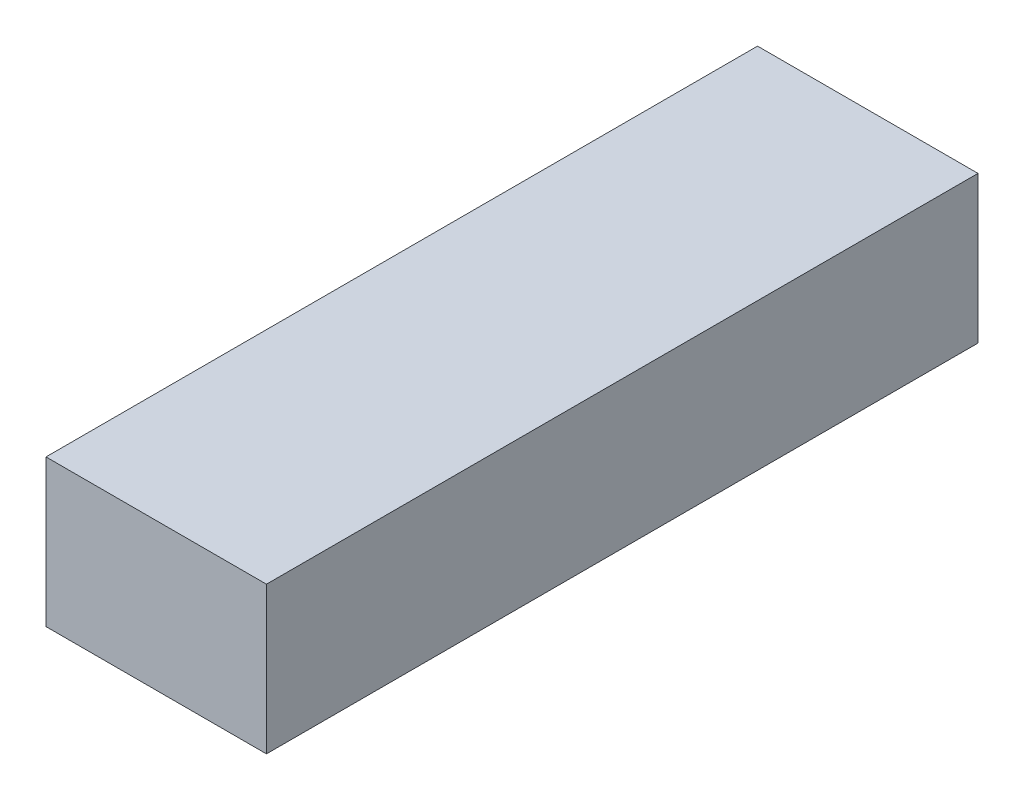
ISO-10303-21;
HEADER;
FILE_DESCRIPTION(('STEP AP214'),'2;1');
FILE_NAME('part.step','',(''),(''),'','','');
FILE_SCHEMA(('AUTOMOTIVE_DESIGN { 1 0 10303 214 1 1 1 1 }'));
ENDSEC;
DATA;
#1=APPLICATION_CONTEXT('core data for automotive mechanical design processes');
#2=APPLICATION_PROTOCOL_DEFINITION('international standard','automotive_design',2000,#1);
#3=PRODUCT_CONTEXT('',#1,'mechanical');
#4=PRODUCT('Part','Part','',(#3));
#5=PRODUCT_RELATED_PRODUCT_CATEGORY('part','',(#4));
#6=PRODUCT_DEFINITION_FORMATION('','',#4);
#7=PRODUCT_DEFINITION_CONTEXT('part definition',#1,'design');
#8=PRODUCT_DEFINITION('design','',#6,#7);
#9=PRODUCT_DEFINITION_SHAPE('','',#8);
#10=(LENGTH_UNIT() NAMED_UNIT(*) SI_UNIT(.MILLI.,.METRE.));
#11=(NAMED_UNIT(*) PLANE_ANGLE_UNIT() SI_UNIT($,.RADIAN.));
#12=(NAMED_UNIT(*) SI_UNIT($,.STERADIAN.) SOLID_ANGLE_UNIT());
#13=UNCERTAINTY_MEASURE_WITH_UNIT(LENGTH_MEASURE(1.E-05),#10,'distance_accuracy_value','');
#14=(GEOMETRIC_REPRESENTATION_CONTEXT(3) GLOBAL_UNCERTAINTY_ASSIGNED_CONTEXT((#13)) GLOBAL_UNIT_ASSIGNED_CONTEXT((#10,
#11,#12)) REPRESENTATION_CONTEXT('',''));
#15=CARTESIAN_POINT('',(0.,0.,0.));
#16=DIRECTION('',(0.,0.,1.));
#17=DIRECTION('',(1.,0.,0.));
#18=AXIS2_PLACEMENT_3D('',#15,#16,#17);
#19=CARTESIAN_POINT('',(-24.003,16.002,154.94));
#20=DIRECTION('',(1.,0.,0.));
#21=DIRECTION('',(0.,1.,0.));
#22=AXIS2_PLACEMENT_3D('',#19,#20,#21);
#23=PLANE('',#22);
#24=DIRECTION('',(0.,-1.,0.));
#25=VECTOR('',#24,1.);
#26=CARTESIAN_POINT('',(-24.003,16.002,0.));
#27=LINE('',#26,#25);
#28=CARTESIAN_POINT('',(-24.003,16.002,0.));
#29=VERTEX_POINT('',#28);
#30=CARTESIAN_POINT('',(-24.003,-16.002,0.));
#31=VERTEX_POINT('',#30);
#32=EDGE_CURVE('E101',#29,#31,#27,.T.);
#33=ORIENTED_EDGE('',*,*,#32,.T.);
#34=DIRECTION('',(0.,0.,-1.));
#35=VECTOR('',#34,1.);
#36=CARTESIAN_POINT('',(-24.003,-16.002,154.94));
#37=LINE('',#36,#35);
#38=CARTESIAN_POINT('',(-24.003,-16.002,154.94));
#39=VERTEX_POINT('',#38);
#40=EDGE_CURVE('E11',#39,#31,#37,.T.);
#41=ORIENTED_EDGE('',*,*,#40,.F.);
#42=DIRECTION('',(0.,-1.,0.));
#43=VECTOR('',#42,1.);
#44=CARTESIAN_POINT('',(-24.003,16.002,154.94));
#45=LINE('',#44,#43);
#46=CARTESIAN_POINT('',(-24.003,16.002,154.94));
#47=VERTEX_POINT('',#46);
#48=EDGE_CURVE('E89',#47,#39,#45,.T.);
#49=ORIENTED_EDGE('',*,*,#48,.F.);
#50=DIRECTION('',(0.,0.,-1.));
#51=VECTOR('',#50,1.);
#52=CARTESIAN_POINT('',(-24.003,16.002,154.94));
#53=LINE('',#52,#51);
#54=EDGE_CURVE('E97',#47,#29,#53,.T.);
#55=ORIENTED_EDGE('',*,*,#54,.T.);
#56=EDGE_LOOP('',(#33,#41,#49,#55));
#57=FACE_BOUND('',#56,.T.);
#58=ADVANCED_FACE('F38',(#57),#23,.F.);
#59=CARTESIAN_POINT('',(24.003,-16.002,154.94));
#60=DIRECTION('',(0.,1.,0.));
#61=DIRECTION('',(-1.,0.,0.));
#62=AXIS2_PLACEMENT_3D('',#59,#60,#61);
#63=PLANE('',#62);
#64=DIRECTION('',(1.,0.,0.));
#65=VECTOR('',#64,1.);
#66=CARTESIAN_POINT('',(24.003,-16.002,0.));
#67=LINE('',#66,#65);
#68=CARTESIAN_POINT('',(24.003,-16.002,0.));
#69=VERTEX_POINT('',#68);
#70=EDGE_CURVE('E93',#31,#69,#67,.T.);
#71=ORIENTED_EDGE('',*,*,#70,.T.);
#72=DIRECTION('',(0.,0.,-1.));
#73=VECTOR('',#72,1.);
#74=CARTESIAN_POINT('',(24.003,-16.002,154.94));
#75=LINE('',#74,#73);
#76=CARTESIAN_POINT('',(24.003,-16.002,154.94));
#77=VERTEX_POINT('',#76);
#78=EDGE_CURVE('E46',#77,#69,#75,.T.);
#79=ORIENTED_EDGE('',*,*,#78,.F.);
#80=DIRECTION('',(1.,0.,0.));
#81=VECTOR('',#80,1.);
#82=CARTESIAN_POINT('',(24.003,-16.002,154.94));
#83=LINE('',#82,#81);
#84=EDGE_CURVE('E84',#39,#77,#83,.T.);
#85=ORIENTED_EDGE('',*,*,#84,.F.);
#86=ORIENTED_EDGE('',*,*,#40,.T.);
#87=EDGE_LOOP('',(#71,#79,#85,#86));
#88=FACE_BOUND('',#87,.T.);
#89=ADVANCED_FACE('F92',(#88),#63,.F.);
#90=CARTESIAN_POINT('',(24.003,16.002,154.94));
#91=DIRECTION('',(-1.,0.,0.));
#92=DIRECTION('',(0.,-1.,0.));
#93=AXIS2_PLACEMENT_3D('',#90,#91,#92);
#94=PLANE('',#93);
#95=DIRECTION('',(0.,1.,0.));
#96=VECTOR('',#95,1.);
#97=CARTESIAN_POINT('',(24.003,16.002,0.));
#98=LINE('',#97,#96);
#99=CARTESIAN_POINT('',(24.003,16.002,0.));
#100=VERTEX_POINT('',#99);
#101=EDGE_CURVE('E71',#69,#100,#98,.T.);
#102=ORIENTED_EDGE('',*,*,#101,.T.);
#103=DIRECTION('',(0.,0.,-1.));
#104=VECTOR('',#103,1.);
#105=CARTESIAN_POINT('',(24.003,16.002,154.94));
#106=LINE('',#105,#104);
#107=CARTESIAN_POINT('',(24.003,16.002,154.94));
#108=VERTEX_POINT('',#107);
#109=EDGE_CURVE('E94',#108,#100,#106,.T.);
#110=ORIENTED_EDGE('',*,*,#109,.F.);
#111=DIRECTION('',(0.,1.,0.));
#112=VECTOR('',#111,1.);
#113=CARTESIAN_POINT('',(24.003,16.002,154.94));
#114=LINE('',#113,#112);
#115=EDGE_CURVE('E87',#77,#108,#114,.T.);
#116=ORIENTED_EDGE('',*,*,#115,.F.);
#117=ORIENTED_EDGE('',*,*,#78,.T.);
#118=EDGE_LOOP('',(#102,#110,#116,#117));
#119=FACE_BOUND('',#118,.T.);
#120=ADVANCED_FACE('F95',(#119),#94,.F.);
#121=CARTESIAN_POINT('',(24.003,16.002,154.94));
#122=DIRECTION('',(0.,-1.,0.));
#123=DIRECTION('',(1.,0.,0.));
#124=AXIS2_PLACEMENT_3D('',#121,#122,#123);
#125=PLANE('',#124);
#126=DIRECTION('',(-1.,0.,0.));
#127=VECTOR('',#126,1.);
#128=CARTESIAN_POINT('',(24.003,16.002,0.));
#129=LINE('',#128,#127);
#130=EDGE_CURVE('E77',#100,#29,#129,.T.);
#131=ORIENTED_EDGE('',*,*,#130,.T.);
#132=ORIENTED_EDGE('',*,*,#54,.F.);
#133=DIRECTION('',(-1.,0.,0.));
#134=VECTOR('',#133,1.);
#135=CARTESIAN_POINT('',(24.003,16.002,154.94));
#136=LINE('',#135,#134);
#137=EDGE_CURVE('E54',#108,#47,#136,.T.);
#138=ORIENTED_EDGE('',*,*,#137,.F.);
#139=ORIENTED_EDGE('',*,*,#109,.T.);
#140=EDGE_LOOP('',(#131,#132,#138,#139));
#141=FACE_BOUND('',#140,.T.);
#142=ADVANCED_FACE('F108',(#141),#125,.F.);
#143=CARTESIAN_POINT('',(0.,0.,154.94));
#144=DIRECTION('',(0.,0.,-1.));
#145=DIRECTION('',(-1.,0.,0.));
#146=AXIS2_PLACEMENT_3D('',#143,#144,#145);
#147=PLANE('',#146);
#148=ORIENTED_EDGE('',*,*,#48,.T.);
#149=ORIENTED_EDGE('',*,*,#84,.T.);
#150=ORIENTED_EDGE('',*,*,#115,.T.);
#151=ORIENTED_EDGE('',*,*,#137,.T.);
#152=EDGE_LOOP('',(#148,#149,#150,#151));
#153=FACE_BOUND('',#152,.T.);
#154=ADVANCED_FACE('F85',(#153),#147,.F.);
#155=CARTESIAN_POINT('',(0.,0.,0.));
#156=DIRECTION('',(0.,0.,-1.));
#157=DIRECTION('',(-1.,0.,0.));
#158=AXIS2_PLACEMENT_3D('',#155,#156,#157);
#159=PLANE('',#158);
#160=ORIENTED_EDGE('',*,*,#32,.F.);
#161=ORIENTED_EDGE('',*,*,#130,.F.);
#162=ORIENTED_EDGE('',*,*,#101,.F.);
#163=ORIENTED_EDGE('',*,*,#70,.F.);
#164=EDGE_LOOP('',(#160,#161,#162,#163));
#165=FACE_BOUND('',#164,.T.);
#166=ADVANCED_FACE('F111',(#165),#159,.T.);
#167=CLOSED_SHELL('',(#58,#89,#120,#142,#154,#166));
#168=MANIFOLD_SOLID_BREP('B2',#167);
#169=ADVANCED_BREP_SHAPE_REPRESENTATION('',(#18,#168),#14);
#170=SHAPE_DEFINITION_REPRESENTATION(#9,#169);
ENDSEC;
END-ISO-10303-21;
